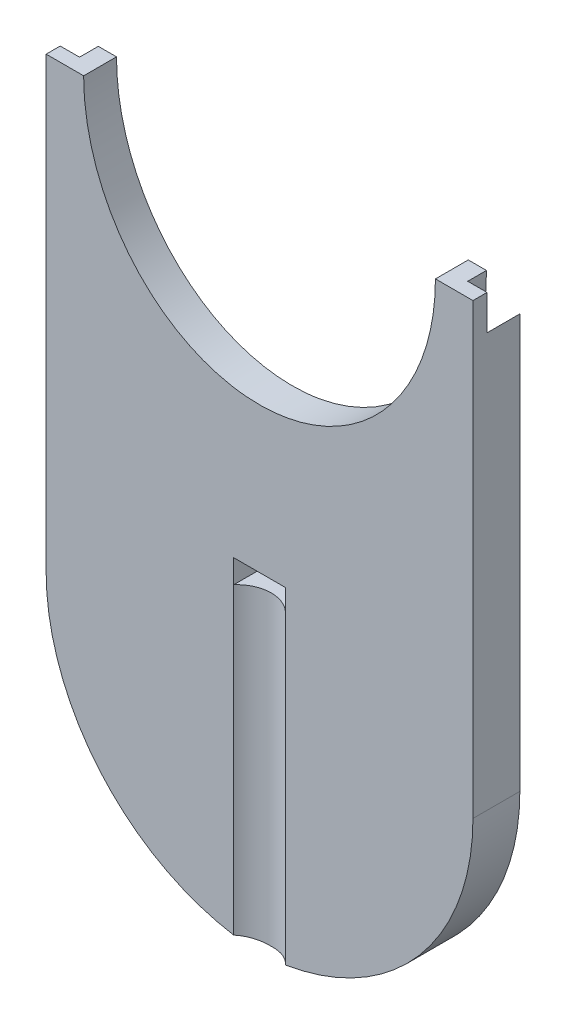
ISO-10303-21;
HEADER;
FILE_DESCRIPTION(('STEP AP214'),'2;1');
FILE_NAME('part.step','',(''),(''),'','','');
FILE_SCHEMA(('AUTOMOTIVE_DESIGN { 1 0 10303 214 1 1 1 1 }'));
ENDSEC;
DATA;
#1=APPLICATION_CONTEXT('core data for automotive mechanical design processes');
#2=APPLICATION_PROTOCOL_DEFINITION('international standard','automotive_design',2000,#1);
#3=PRODUCT_CONTEXT('',#1,'mechanical');
#4=PRODUCT('Part','Part','',(#3));
#5=PRODUCT_RELATED_PRODUCT_CATEGORY('part','',(#4));
#6=PRODUCT_DEFINITION_FORMATION('','',#4);
#7=PRODUCT_DEFINITION_CONTEXT('part definition',#1,'design');
#8=PRODUCT_DEFINITION('design','',#6,#7);
#9=PRODUCT_DEFINITION_SHAPE('','',#8);
#10=(LENGTH_UNIT() NAMED_UNIT(*) SI_UNIT(.MILLI.,.METRE.));
#11=(NAMED_UNIT(*) PLANE_ANGLE_UNIT() SI_UNIT($,.RADIAN.));
#12=(NAMED_UNIT(*) SI_UNIT($,.STERADIAN.) SOLID_ANGLE_UNIT());
#13=UNCERTAINTY_MEASURE_WITH_UNIT(LENGTH_MEASURE(1.E-05),#10,'distance_accuracy_value','');
#14=(GEOMETRIC_REPRESENTATION_CONTEXT(3) GLOBAL_UNCERTAINTY_ASSIGNED_CONTEXT((#13)) GLOBAL_UNIT_ASSIGNED_CONTEXT((#10,
#11,#12)) REPRESENTATION_CONTEXT('',''));
#15=CARTESIAN_POINT('',(0.,0.,0.));
#16=DIRECTION('',(0.,0.,1.));
#17=DIRECTION('',(1.,0.,0.));
#18=AXIS2_PLACEMENT_3D('',#15,#16,#17);
#19=CARTESIAN_POINT('',(22.75,-25.1249989546407,10.));
#20=DIRECTION('',(0.,0.,1.));
#21=DIRECTION('',(1.,0.,0.));
#22=AXIS2_PLACEMENT_3D('',#19,#20,#21);
#23=PLANE('',#22);
#24=DIRECTION('',(0.,1.,0.));
#25=VECTOR('',#24,1.);
#26=CARTESIAN_POINT('',(-5.5084218576703,-72.9803547251444,10.));
#27=LINE('',#26,#25);
#28=CARTESIAN_POINT('',(-5.5084218576703,-142.676781002882,10.));
#29=VERTEX_POINT('',#28);
#30=CARTESIAN_POINT('',(-5.5084218576703,-77.9803547251444,10.));
#31=VERTEX_POINT('',#30);
#32=EDGE_CURVE('E349',#29,#31,#27,.T.);
#33=ORIENTED_EDGE('',*,*,#32,.T.);
#34=DIRECTION('',(0.,1.,0.));
#35=VECTOR('',#34,1.);
#36=CARTESIAN_POINT('',(-5.5084218576703,-49.0526768398925,10.));
#37=LINE('',#36,#35);
#38=CARTESIAN_POINT('',(-5.5084218576703,-72.9803547251444,10.));
#39=VERTEX_POINT('',#38);
#40=EDGE_CURVE('E257',#31,#39,#37,.T.);
#41=ORIENTED_EDGE('',*,*,#40,.T.);
#42=DIRECTION('',(1.,0.,0.));
#43=VECTOR('',#42,1.);
#44=CARTESIAN_POINT('',(14.1207890711649,-72.9803547251444,10.));
#45=LINE('',#44,#43);
#46=CARTESIAN_POINT('',(5.4915781423297,-72.9803547251444,10.));
#47=VERTEX_POINT('',#46);
#48=EDGE_CURVE('E370',#39,#47,#45,.T.);
#49=ORIENTED_EDGE('',*,*,#48,.T.);
#50=DIRECTION('',(0.,-1.,0.));
#51=VECTOR('',#50,1.);
#52=CARTESIAN_POINT('',(5.49157814232972,-51.5526768398925,10.));
#53=LINE('',#52,#51);
#54=CARTESIAN_POINT('',(5.4915781423297,-77.9803547251444,10.));
#55=VERTEX_POINT('',#54);
#56=EDGE_CURVE('E374',#47,#55,#53,.T.);
#57=ORIENTED_EDGE('',*,*,#56,.T.);
#58=DIRECTION('',(0.,-1.,0.));
#59=VECTOR('',#58,1.);
#60=CARTESIAN_POINT('',(5.4915781423297,-72.9803547251444,10.));
#61=LINE('',#60,#59);
#62=CARTESIAN_POINT('',(5.4915781423297,-142.679527400056,10.));
#63=VERTEX_POINT('',#62);
#64=EDGE_CURVE('E360',#55,#63,#61,.T.);
#65=ORIENTED_EDGE('',*,*,#64,.T.);
#66=CARTESIAN_POINT('',(-2.17163325661595,-95.6278557144678,10.));
#67=DIRECTION('',(0.,0.,1.));
#68=DIRECTION('',(0.045553993187648,-0.99896187800369,0.));
#69=AXIS2_PLACEMENT_3D('',#66,#67,#68);
#70=CIRCLE('',#69,47.6716332566159);
#71=CARTESIAN_POINT('',(45.5,-95.6278557144678,10.));
#72=VERTEX_POINT('',#71);
#73=EDGE_CURVE('E397',#63,#72,#70,.T.);
#74=ORIENTED_EDGE('',*,*,#73,.T.);
#75=DIRECTION('',(0.,1.,0.));
#76=VECTOR('',#75,1.);
#77=CARTESIAN_POINT('',(45.5,-50.25,10.));
#78=LINE('',#77,#76);
#79=CARTESIAN_POINT('',(45.5,2.09071863821464E-06,10.));
#80=VERTEX_POINT('',#79);
#81=EDGE_CURVE('E10',#72,#80,#78,.T.);
#82=ORIENTED_EDGE('',*,*,#81,.T.);
#83=DIRECTION('',(1.,0.,0.));
#84=VECTOR('',#83,1.);
#85=CARTESIAN_POINT('',(-45.5,0.,10.));
#86=LINE('',#85,#84);
#87=CARTESIAN_POINT('',(37.5,0.,10.));
#88=VERTEX_POINT('',#87);
#89=EDGE_CURVE('E320',#88,#80,#86,.T.);
#90=ORIENTED_EDGE('',*,*,#89,.F.);
#91=CARTESIAN_POINT('',(0.,0.,10.));
#92=DIRECTION('',(0.,0.,-1.));
#93=DIRECTION('',(0.,1.,0.));
#94=AXIS2_PLACEMENT_3D('',#91,#92,#93);
#95=ELLIPSE('',#94,42.,37.5);
#96=CARTESIAN_POINT('',(-37.5,0.,10.));
#97=VERTEX_POINT('',#96);
#98=EDGE_CURVE('E296',#88,#97,#95,.T.);
#99=ORIENTED_EDGE('',*,*,#98,.T.);
#100=DIRECTION('',(1.,0.,0.));
#101=VECTOR('',#100,1.);
#102=CARTESIAN_POINT('',(-45.5,0.,10.));
#103=LINE('',#102,#101);
#104=CARTESIAN_POINT('',(-45.5,2.09071863821464E-06,10.));
#105=VERTEX_POINT('',#104);
#106=EDGE_CURVE('E331',#105,#97,#103,.T.);
#107=ORIENTED_EDGE('',*,*,#106,.F.);
#108=DIRECTION('',(0.,-1.,0.));
#109=VECTOR('',#108,1.);
#110=CARTESIAN_POINT('',(-45.5,-50.25,10.));
#111=LINE('',#110,#109);
#112=CARTESIAN_POINT('',(-45.5,-95.6278557144678,10.));
#113=VERTEX_POINT('',#112);
#114=EDGE_CURVE('E283',#105,#113,#111,.T.);
#115=ORIENTED_EDGE('',*,*,#114,.T.);
#116=CARTESIAN_POINT('',(2.17163325661593,-95.6278557144678,10.));
#117=DIRECTION('',(0.,0.,1.));
#118=DIRECTION('',(-1.,0.,0.));
#119=AXIS2_PLACEMENT_3D('',#116,#117,#118);
#120=CIRCLE('',#119,47.6716332566159);
#121=EDGE_CURVE('E25',#113,#29,#120,.T.);
#122=ORIENTED_EDGE('',*,*,#121,.T.);
#123=EDGE_LOOP('',(#33,#41,#49,#57,#65,#74,#82,#90,#99,#107,#115,#122));
#124=FACE_BOUND('',#123,.T.);
#125=ADVANCED_FACE('F16',(#124),#23,.T.);
#126=CARTESIAN_POINT('',(45.5,-95.6278557144678,0.));
#127=DIRECTION('',(1.,0.,0.));
#128=DIRECTION('',(0.,1.,0.));
#129=AXIS2_PLACEMENT_3D('',#126,#127,#128);
#130=PLANE('',#129);
#131=DIRECTION('',(0.,1.,0.));
#132=VECTOR('',#131,1.);
#133=CARTESIAN_POINT('',(45.5,-48.4694449461962,7.));
#134=LINE('',#133,#132);
#135=CARTESIAN_POINT('',(45.5,-7.45529948541666,7.));
#136=VERTEX_POINT('',#135);
#137=CARTESIAN_POINT('',(45.5,1.48549092556343E-08,7.));
#138=VERTEX_POINT('',#137);
#139=EDGE_CURVE('E341',#136,#138,#134,.T.);
#140=ORIENTED_EDGE('',*,*,#139,.T.);
#141=DIRECTION('',(0.,0.,1.));
#142=VECTOR('',#141,1.);
#143=CARTESIAN_POINT('',(45.5,2.09071864709642E-06,0.));
#144=LINE('',#143,#142);
#145=EDGE_CURVE('E324',#138,#80,#144,.T.);
#146=ORIENTED_EDGE('',*,*,#145,.T.);
#147=ORIENTED_EDGE('',*,*,#81,.F.);
#148=DIRECTION('',(0.,0.,1.));
#149=VECTOR('',#148,1.);
#150=CARTESIAN_POINT('',(45.5,-95.6278557144678,0.));
#151=LINE('',#150,#149);
#152=CARTESIAN_POINT('',(45.5,-95.6278557144678,0.));
#153=VERTEX_POINT('',#152);
#154=EDGE_CURVE('E393',#153,#72,#151,.T.);
#155=ORIENTED_EDGE('',*,*,#154,.F.);
#156=DIRECTION('',(0.,1.,0.));
#157=VECTOR('',#156,1.);
#158=CARTESIAN_POINT('',(45.5,-50.25,0.));
#159=LINE('',#158,#157);
#160=CARTESIAN_POINT('',(45.5,-7.45529948541665,0.));
#161=VERTEX_POINT('',#160);
#162=EDGE_CURVE('E317',#153,#161,#159,.T.);
#163=ORIENTED_EDGE('',*,*,#162,.T.);
#164=CARTESIAN_POINT('',(45.5,-7.45529948541668,0.));
#165=CARTESIAN_POINT('',(45.5,-7.45529948541668,1.16666666666667));
#166=CARTESIAN_POINT('',(45.5,-7.4552994854167,2.33333333333333));
#167=CARTESIAN_POINT('',(45.5,-7.4552994854167,4.66666666666667));
#168=CARTESIAN_POINT('',(45.5,-7.45529948541668,5.83333333333333));
#169=CARTESIAN_POINT('',(45.5,-7.45529948541668,7.));
#170=(BOUNDED_CURVE() B_SPLINE_CURVE(3,(#164,#165,#166,#167,#168,#169),.UNSPECIFIED.,.F.,
.F.) B_SPLINE_CURVE_WITH_KNOTS((4,2,4),(0.,0.35,0.7),
.UNSPECIFIED.) CURVE() GEOMETRIC_REPRESENTATION_ITEM() RATIONAL_B_SPLINE_CURVE((1.,1.,1.,1.,1.,1.)) REPRESENTATION_ITEM(''));
#171=EDGE_CURVE('E219',#161,#136,#170,.T.);
#172=ORIENTED_EDGE('',*,*,#171,.T.);
#173=EDGE_LOOP('',(#140,#146,#147,#155,#163,#172));
#174=FACE_BOUND('',#173,.T.);
#175=ADVANCED_FACE('F524',(#174),#130,.T.);
#176=CARTESIAN_POINT('',(2.17163325661593,-95.6278557144678,0.));
#177=DIRECTION('',(0.,0.,1.));
#178=DIRECTION('',(-1.,0.,0.));
#179=AXIS2_PLACEMENT_3D('',#176,#177,#178);
#180=CYLINDRICAL_SURFACE('',#179,47.6716332566159);
#181=CARTESIAN_POINT('',(0.,-143.25,7.50000485806234));
#182=CARTESIAN_POINT('',(-0.132266234072011,-143.243970799422,7.49983934604242));
#183=CARTESIAN_POINT('',(-0.264520868757158,-143.237385382734,7.50311496688742));
#184=CARTESIAN_POINT('',(-0.527456060357194,-143.223198539967,7.51663436261154));
#185=CARTESIAN_POINT('',(-0.658140278993675,-143.215606486264,7.52681705138826));
#186=CARTESIAN_POINT('',(-0.917930342853592,-143.199444566909,7.55414736714306));
#187=CARTESIAN_POINT('',(-1.04704095310796,-143.190880800687,7.57125310819131));
#188=CARTESIAN_POINT('',(-1.30367544691454,-143.172816950904,7.61240565050816));
#189=CARTESIAN_POINT('',(-1.43120299533039,-143.163319835615,7.63643088840948));
#190=CARTESIAN_POINT('',(-1.68466795864271,-143.14342913452,7.69140230488229));
#191=CARTESIAN_POINT('',(-1.81060559707415,-143.133035676382,7.72234749882493));
#192=CARTESIAN_POINT('',(-2.06088868148641,-143.111391791236,7.79113956352674));
#193=CARTESIAN_POINT('',(-2.18522865897559,-143.100139038207,7.82900558369432));
#194=CARTESIAN_POINT('',(-2.43232133256894,-143.076814678625,7.91161268590655));
#195=CARTESIAN_POINT('',(-2.55506087677138,-143.064738755383,7.9563918639072));
#196=CARTESIAN_POINT('',(-2.79894466796249,-143.039807063961,8.05283165125828));
#197=CARTESIAN_POINT('',(-2.92006633012146,-143.026945515162,8.10454777778846));
#198=CARTESIAN_POINT('',(-3.15894016168604,-143.000674700601,8.21391406508495));
#199=CARTESIAN_POINT('',(-3.27670394494916,-142.987267851546,8.27153946666427));
#200=CARTESIAN_POINT('',(-3.50795697526813,-142.960088940597,8.39228801908526));
#201=CARTESIAN_POINT('',(-3.62147544018404,-142.946321332881,8.45535614804144));
#202=CARTESIAN_POINT('',(-3.84423414676965,-142.918515202438,8.58699862455977));
#203=CARTESIAN_POINT('',(-3.95349743215646,-142.904479027387,8.65553444610474));
#204=CARTESIAN_POINT('',(-4.16776197365419,-142.876224140182,8.79808851154432));
#205=CARTESIAN_POINT('',(-4.27277776441985,-142.862006317345,8.87208507813975));
#206=CARTESIAN_POINT('',(-4.47856166401248,-142.833473030899,9.02554546418058));
#207=CARTESIAN_POINT('',(-4.57933379283184,-142.819157675334,9.10500391277876));
#208=CARTESIAN_POINT('',(-4.77664970840479,-142.790509783494,9.26937078447344));
#209=CARTESIAN_POINT('',(-4.87318527823608,-142.776177264816,9.35428907363077));
#210=CARTESIAN_POINT('',(-5.06204456818289,-142.747572286002,9.52956243617465));
#211=CARTESIAN_POINT('',(-5.15434652513537,-142.733300418478,9.61994103691601));
#212=CARTESIAN_POINT('',(-5.3347742099065,-142.704886866223,9.80611512995563));
#213=CARTESIAN_POINT('',(-5.42286395294517,-142.690746927988,9.90194577742113));
#214=CARTESIAN_POINT('',(-5.50842185767039,-142.676781002882,10.));
#215=B_SPLINE_CURVE_WITH_KNOTS('',3,(#181,#182,#183,#184,#185,#186,#187,#188,#189,#190,#191,
#192,#193,#194,#195,#196,#197,#198,#199,#200,#201,#202,#203,#204,#205,#206,#207,#208,#209,#210,
#211,#212,#213,#214),.UNSPECIFIED.,.F.,.F.,(4,2,2,2,2,2,2,2,2,2,2,2,2,2,2,2,4),(0.,
0.39717922357584,0.79089081964116,1.18225516161429,1.57241284454208,1.96251504787677,
2.35371344089033,2.74715006669928,3.14394764301723,3.53914580567487,3.93073436351749,
4.31977320328926,4.7073431311812,5.09453725518362,5.4824518609409,5.8721771547303,
6.26478825994508),.UNSPECIFIED.);
#216=CARTESIAN_POINT('',(0.,-143.25,7.50000485806234));
#217=VERTEX_POINT('',#216);
#218=EDGE_CURVE('E488',#217,#29,#215,.T.);
#219=ORIENTED_EDGE('',*,*,#218,.T.);
#220=ORIENTED_EDGE('',*,*,#121,.F.);
#221=DIRECTION('',(0.,0.,1.));
#222=VECTOR('',#221,1.);
#223=CARTESIAN_POINT('',(-45.5,-95.6278557144678,0.));
#224=LINE('',#223,#222);
#225=CARTESIAN_POINT('',(-45.5,-95.6278557144678,0.));
#226=VERTEX_POINT('',#225);
#227=EDGE_CURVE('E279',#226,#113,#224,.T.);
#228=ORIENTED_EDGE('',*,*,#227,.F.);
#229=CARTESIAN_POINT('',(2.17163325661593,-95.6278557144678,0.));
#230=DIRECTION('',(0.,0.,1.));
#231=DIRECTION('',(-1.,0.,0.));
#232=AXIS2_PLACEMENT_3D('',#229,#230,#231);
#233=CIRCLE('',#232,47.6716332566159);
#234=CARTESIAN_POINT('',(0.,-143.25,0.));
#235=VERTEX_POINT('',#234);
#236=EDGE_CURVE('E226',#226,#235,#233,.T.);
#237=ORIENTED_EDGE('',*,*,#236,.T.);
#238=DIRECTION('',(0.,0.,1.));
#239=VECTOR('',#238,1.);
#240=CARTESIAN_POINT('',(0.,-143.25,0.));
#241=LINE('',#240,#239);
#242=EDGE_CURVE('E46',#235,#217,#241,.T.);
#243=ORIENTED_EDGE('',*,*,#242,.T.);
#244=EDGE_LOOP('',(#219,#220,#228,#237,#243));
#245=FACE_BOUND('',#244,.T.);
#246=ADVANCED_FACE('F417',(#245),#180,.T.);
#247=CARTESIAN_POINT('',(-2.17163325661595,-95.6278557144678,0.));
#248=DIRECTION('',(0.,0.,1.));
#249=DIRECTION('',(0.045553993187648,-0.99896187800369,0.));
#250=AXIS2_PLACEMENT_3D('',#247,#248,#249);
#251=CYLINDRICAL_SURFACE('',#250,47.6716332566159);
#252=CARTESIAN_POINT('',(5.49157814232965,-142.679527400056,10.));
#253=CARTESIAN_POINT('',(5.40629364962369,-142.693417358953,9.90225923486806));
#254=CARTESIAN_POINT('',(5.31849130161811,-142.70747967928,9.80672983022758));
#255=CARTESIAN_POINT('',(5.13865322151899,-142.735737836954,9.62111571176352));
#256=CARTESIAN_POINT('',(5.04665267379115,-142.749931974671,9.53099663579133));
#257=CARTESIAN_POINT('',(4.85841109105706,-142.778381804661,9.35619987930545));
#258=CARTESIAN_POINT('',(4.76219118698833,-142.792636925556,9.27149936797997));
#259=CARTESIAN_POINT('',(4.5655213324165,-142.821130872378,9.10752570825447));
#260=CARTESIAN_POINT('',(4.46507914014719,-142.835369682714,9.02824325288778));
#261=CARTESIAN_POINT('',(4.25996971566595,-142.86375127191,8.87509269547319));
#262=CARTESIAN_POINT('',(4.15529816900696,-142.877893934587,8.80123035046421));
#263=CARTESIAN_POINT('',(3.94173666536859,-142.906000445045,8.65890261389557));
#264=CARTESIAN_POINT('',(3.83283202548166,-142.919963395304,8.59045908410692));
#265=CARTESIAN_POINT('',(3.6108048064972,-142.94762561495,8.4589598079323));
#266=CARTESIAN_POINT('',(3.49765915323556,-142.961322539094,8.39594255629085));
#267=CARTESIAN_POINT('',(3.26716681182787,-142.988363101772,8.27525262514056));
#268=CARTESIAN_POINT('',(3.14979097171889,-143.001702308116,8.21763469279182));
#269=CARTESIAN_POINT('',(2.91171514809088,-143.027840826246,8.10825428678714));
#270=CARTESIAN_POINT('',(2.79100390748646,-143.040637808596,8.05651573090725));
#271=CARTESIAN_POINT('',(2.54792799767465,-143.06544791765,7.95999371382921));
#272=CARTESIAN_POINT('',(2.42558562085651,-143.077466708172,7.9151556688715));
#273=CARTESIAN_POINT('',(2.17927506516264,-143.100684056865,7.83239153454287));
#274=CARTESIAN_POINT('',(2.05531981848716,-143.111886829381,7.79442816348843));
#275=CARTESIAN_POINT('',(1.80579357008623,-143.133437821015,7.72540278387752));
#276=CARTESIAN_POINT('',(1.68022788357395,-143.143788282776,7.69432227486912));
#277=CARTESIAN_POINT('',(1.4274941125835,-143.163599825986,7.63904164294762));
#278=CARTESIAN_POINT('',(1.30032569712454,-143.1730607202,7.61484296635155));
#279=CARTESIAN_POINT('',(1.0443966176023,-143.191058723144,7.57330520693217));
#280=CARTESIAN_POINT('',(0.915632202653743,-143.199592831637,7.55598794652357));
#281=CARTESIAN_POINT('',(0.65652156871844,-143.215701786283,7.52819640794482));
#282=CARTESIAN_POINT('',(0.526170493265594,-143.223270531053,7.51776406725542));
#283=CARTESIAN_POINT('',(0.263888610518901,-143.237416817577,7.50370755276247));
#284=CARTESIAN_POINT('',(0.131954018319664,-143.24398501564,7.50014431618306));
#285=CARTESIAN_POINT('',(0.,-143.25,7.50000485806234));
#286=B_SPLINE_CURVE_WITH_KNOTS('',3,(#252,#253,#254,#255,#256,#257,#258,#259,#260,#261,#262,
#263,#264,#265,#266,#267,#268,#269,#270,#271,#272,#273,#274,#275,#276,#277,#278,#279,#280,#281,
#282,#283,#284,#285),.UNSPECIFIED.,.F.,.F.,(4,2,2,2,2,2,2,2,2,2,2,2,2,2,2,2,4),(0.,
0.391346126638425,0.779863722880808,1.16661876226456,1.55269181757916,1.93916918138053,
2.32713374938534,2.71765604500112,3.11178574978258,3.50746537893631,3.8998335425977,
4.29000561656422,4.67911586217709,5.06830782462753,5.45872433101097,5.85149751959477,
6.24773932865095),.UNSPECIFIED.);
#287=EDGE_CURVE('E400',#63,#217,#286,.T.);
#288=ORIENTED_EDGE('',*,*,#287,.T.);
#289=ORIENTED_EDGE('',*,*,#242,.F.);
#290=CARTESIAN_POINT('',(-2.17163325661595,-95.6278557144678,0.));
#291=DIRECTION('',(0.,0.,1.));
#292=DIRECTION('',(0.045553993187648,-0.99896187800369,0.));
#293=AXIS2_PLACEMENT_3D('',#290,#291,#292);
#294=CIRCLE('',#293,47.6716332566159);
#295=EDGE_CURVE('E229',#235,#153,#294,.T.);
#296=ORIENTED_EDGE('',*,*,#295,.T.);
#297=ORIENTED_EDGE('',*,*,#154,.T.);
#298=ORIENTED_EDGE('',*,*,#73,.F.);
#299=EDGE_LOOP('',(#288,#289,#296,#297,#298));
#300=FACE_BOUND('',#299,.T.);
#301=ADVANCED_FACE('F407',(#300),#251,.T.);
#302=CARTESIAN_POINT('',(22.75,-25.1249989546407,0.));
#303=DIRECTION('',(0.,0.,1.));
#304=DIRECTION('',(1.,0.,0.));
#305=AXIS2_PLACEMENT_3D('',#302,#303,#304);
#306=PLANE('',#305);
#307=CARTESIAN_POINT('',(0.,-94.,0.));
#308=DIRECTION('',(0.,0.,1.));
#309=DIRECTION('',(1.,0.,0.));
#310=AXIS2_PLACEMENT_3D('',#307,#308,#309);
#311=CIRCLE('',#310,35.);
#312=CARTESIAN_POINT('',(-35.,-94.,0.));
#313=VERTEX_POINT('',#312);
#314=EDGE_CURVE('E195',#313,#313,#311,.T.);
#315=ORIENTED_EDGE('',*,*,#314,.T.);
#316=EDGE_LOOP('',(#315));
#317=FACE_BOUND('',#316,.T.);
#318=CARTESIAN_POINT('',(-45.5,-7.40077679004306,0.));
#319=CARTESIAN_POINT('',(-44.9242894961324,-11.7092066995012,0.));
#320=CARTESIAN_POINT('',(-43.8513307317373,-15.936979239285,0.));
#321=CARTESIAN_POINT('',(-42.2999120771305,-19.9426239226419,0.));
#322=CARTESIAN_POINT('',(-39.2436607412134,-27.8336318580996,0.));
#323=CARTESIAN_POINT('',(-34.3377834230488,-34.8459322215829,0.));
#324=CARTESIAN_POINT('',(-28.1852994199222,-40.1083439337288,0.));
#325=CARTESIAN_POINT('',(-22.1148975575752,-45.3005482274113,0.));
#326=CARTESIAN_POINT('',(-14.8436614856178,-48.7784209894615,0.));
#327=CARTESIAN_POINT('',(-7.25192964079896,-50.1154345595724,0.));
#328=CARTESIAN_POINT('',(0.284202415795431,-51.4426562043531,0.));
#329=CARTESIAN_POINT('',(8.11962100097684,-50.6574404472079,0.));
#330=CARTESIAN_POINT('',(15.3141856693824,-47.8553005094194,0.));
#331=CARTESIAN_POINT('',(22.5550355889471,-45.0351333862789,0.));
#332=CARTESIAN_POINT('',(29.1313878144454,-40.1784440123707,0.));
#333=CARTESIAN_POINT('',(34.2518511635703,-33.8768129275057,0.));
#334=CARTESIAN_POINT('',(39.717473812193,-27.1504025946224,0.));
#335=CARTESIAN_POINT('',(43.5075621558035,-18.7899813228029,0.));
#336=CARTESIAN_POINT('',(45.1096223466372,-9.9372824846293,0.));
#337=CARTESIAN_POINT('',(45.2586684125514,-9.11368051130592,0.));
#338=CARTESIAN_POINT('',(45.388776121754,-8.28601168547003,0.));
#339=CARTESIAN_POINT('',(45.5,-7.45529948541665,0.));
#340=(BOUNDED_CURVE() B_SPLINE_CURVE(3,(#318,#319,#320,#321,#322,#323,#324,#325,#326,#327,#328,
#329,#330,#331,#332,#333,#334,#335,#336,#337,#338,#339),.UNSPECIFIED.,.F.,
.F.) B_SPLINE_CURVE_WITH_KNOTS((4,3,3,3,3,3,3,4),(-4.56587821234115,-4.30819866157579,
-3.80057715726638,-3.29972798422322,-2.80254689489572,-2.30216725879691,-1.76805811954515,
-1.7183678105107),
.UNSPECIFIED.) CURVE() GEOMETRIC_REPRESENTATION_ITEM() RATIONAL_B_SPLINE_CURVE((1.,1.,1.,1.,1.,
1.,1.,1.,1.,1.,1.,1.,1.,1.,1.,1.,1.,1.,1.,1.,1.,1.)) REPRESENTATION_ITEM(''));
#341=CARTESIAN_POINT('',(-45.5,-7.40077679004306,0.));
#342=VERTEX_POINT('',#341);
#343=EDGE_CURVE('E235',#342,#161,#340,.T.);
#344=ORIENTED_EDGE('',*,*,#343,.T.);
#345=ORIENTED_EDGE('',*,*,#162,.F.);
#346=ORIENTED_EDGE('',*,*,#295,.F.);
#347=ORIENTED_EDGE('',*,*,#236,.F.);
#348=DIRECTION('',(0.,-1.,0.));
#349=VECTOR('',#348,1.);
#350=CARTESIAN_POINT('',(-45.5,-50.25,0.));
#351=LINE('',#350,#349);
#352=EDGE_CURVE('E275',#342,#226,#351,.T.);
#353=ORIENTED_EDGE('',*,*,#352,.F.);
#354=EDGE_LOOP('',(#344,#345,#346,#347,#353));
#355=FACE_BOUND('',#354,.T.);
#356=ADVANCED_FACE('F201',(#317,#355),#306,.F.);
#357=CARTESIAN_POINT('',(0.,-94.,0.));
#358=DIRECTION('',(0.,0.,-1.));
#359=DIRECTION('',(1.,0.,0.));
#360=AXIS2_PLACEMENT_3D('',#357,#358,#359);
#361=CYLINDRICAL_SURFACE('',#360,32.);
#362=CARTESIAN_POINT('',(0.,-94.,-13.));
#363=DIRECTION('',(0.,0.,-1.));
#364=DIRECTION('',(1.,0.,0.));
#365=AXIS2_PLACEMENT_3D('',#362,#363,#364);
#366=CIRCLE('',#365,32.);
#367=CARTESIAN_POINT('',(-32.,-94.,-13.));
#368=VERTEX_POINT('',#367);
#369=EDGE_CURVE('E380',#368,#368,#366,.T.);
#370=ORIENTED_EDGE('',*,*,#369,.F.);
#371=DIRECTION('',(0.,0.,1.));
#372=VECTOR('',#371,1.);
#373=CARTESIAN_POINT('',(-32.,-94.,0.));
#374=LINE('',#373,#372);
#375=CARTESIAN_POINT('',(-32.,-94.,3.));
#376=VERTEX_POINT('',#375);
#377=EDGE_CURVE('E300',#368,#376,#374,.T.);
#378=ORIENTED_EDGE('',*,*,#377,.T.);
#379=CARTESIAN_POINT('',(0.,-94.,3.));
#380=DIRECTION('',(0.,0.,-1.));
#381=DIRECTION('',(1.,0.,0.));
#382=AXIS2_PLACEMENT_3D('',#379,#380,#381);
#383=CIRCLE('',#382,32.);
#384=EDGE_CURVE('E214',#376,#376,#383,.T.);
#385=ORIENTED_EDGE('',*,*,#384,.T.);
#386=ORIENTED_EDGE('',*,*,#377,.F.);
#387=EDGE_LOOP('',(#370,#378,#385,#386));
#388=FACE_BOUND('',#387,.T.);
#389=ADVANCED_FACE('F583',(#388),#361,.T.);
#390=CARTESIAN_POINT('',(0.,-94.,0.));
#391=DIRECTION('',(0.,0.,-1.));
#392=DIRECTION('',(1.,0.,0.));
#393=AXIS2_PLACEMENT_3D('',#390,#391,#392);
#394=CYLINDRICAL_SURFACE('',#393,27.5);
#395=CARTESIAN_POINT('',(0.,-94.,-13.));
#396=DIRECTION('',(0.,0.,1.));
#397=DIRECTION('',(1.,0.,0.));
#398=AXIS2_PLACEMENT_3D('',#395,#396,#397);
#399=CIRCLE('',#398,27.5);
#400=CARTESIAN_POINT('',(-27.5,-94.,-13.));
#401=VERTEX_POINT('',#400);
#402=EDGE_CURVE('E384',#401,#401,#399,.T.);
#403=ORIENTED_EDGE('',*,*,#402,.F.);
#404=DIRECTION('',(0.,0.,1.));
#405=VECTOR('',#404,1.);
#406=CARTESIAN_POINT('',(-27.5,-94.,0.));
#407=LINE('',#406,#405);
#408=CARTESIAN_POINT('',(-27.5,-94.,5.));
#409=VERTEX_POINT('',#408);
#410=EDGE_CURVE('E297',#401,#409,#407,.T.);
#411=ORIENTED_EDGE('',*,*,#410,.T.);
#412=CARTESIAN_POINT('',(0.,-94.,5.));
#413=DIRECTION('',(0.,0.,1.));
#414=DIRECTION('',(1.,0.,0.));
#415=AXIS2_PLACEMENT_3D('',#412,#413,#414);
#416=CIRCLE('',#415,27.5);
#417=EDGE_CURVE('E301',#409,#409,#416,.T.);
#418=ORIENTED_EDGE('',*,*,#417,.T.);
#419=ORIENTED_EDGE('',*,*,#410,.F.);
#420=EDGE_LOOP('',(#403,#411,#418,#419));
#421=FACE_BOUND('',#420,.T.);
#422=ADVANCED_FACE('F572',(#421),#394,.F.);
#423=CARTESIAN_POINT('',(22.75,-25.1249989546407,5.));
#424=DIRECTION('',(0.,0.,1.));
#425=DIRECTION('',(1.,0.,0.));
#426=AXIS2_PLACEMENT_3D('',#423,#424,#425);
#427=PLANE('',#426);
#428=DIRECTION('',(0.,1.,0.));
#429=VECTOR('',#428,1.);
#430=CARTESIAN_POINT('',(5.49157814232972,-51.5526768398925,5.));
#431=LINE('',#430,#429);
#432=CARTESIAN_POINT('',(5.4915781423297,-77.9803547251444,5.));
#433=VERTEX_POINT('',#432);
#434=CARTESIAN_POINT('',(5.4915781423297,-72.9803547251444,5.));
#435=VERTEX_POINT('',#434);
#436=EDGE_CURVE('E377',#433,#435,#431,.T.);
#437=ORIENTED_EDGE('',*,*,#436,.T.);
#438=DIRECTION('',(-1.,0.,0.));
#439=VECTOR('',#438,1.);
#440=CARTESIAN_POINT('',(14.1207890711649,-72.9803547251444,5.));
#441=LINE('',#440,#439);
#442=CARTESIAN_POINT('',(-5.5084218576703,-72.9803547251444,5.));
#443=VERTEX_POINT('',#442);
#444=EDGE_CURVE('E335',#435,#443,#441,.T.);
#445=ORIENTED_EDGE('',*,*,#444,.T.);
#446=DIRECTION('',(0.,-1.,0.));
#447=VECTOR('',#446,1.);
#448=CARTESIAN_POINT('',(-5.5084218576703,-49.0526768398925,5.));
#449=LINE('',#448,#447);
#450=CARTESIAN_POINT('',(-5.5084218576703,-77.9803547251444,5.));
#451=VERTEX_POINT('',#450);
#452=EDGE_CURVE('E250',#443,#451,#449,.T.);
#453=ORIENTED_EDGE('',*,*,#452,.T.);
#454=DIRECTION('',(1.,0.,0.));
#455=VECTOR('',#454,1.);
#456=CARTESIAN_POINT('',(8.62078907116485,-77.9803547251444,5.));
#457=LINE('',#456,#455);
#458=EDGE_CURVE('E351',#451,#433,#457,.T.);
#459=ORIENTED_EDGE('',*,*,#458,.T.);
#460=EDGE_LOOP('',(#437,#445,#453,#459));
#461=FACE_BOUND('',#460,.T.);
#462=ORIENTED_EDGE('',*,*,#417,.F.);
#463=EDGE_LOOP('',(#462));
#464=FACE_BOUND('',#463,.T.);
#465=ADVANCED_FACE('F568',(#461,#464),#427,.F.);
#466=CARTESIAN_POINT('',(0.,-94.,-13.));
#467=DIRECTION('',(0.,0.,-1.));
#468=DIRECTION('',(0.,-1.,0.));
#469=AXIS2_PLACEMENT_3D('',#466,#467,#468);
#470=PLANE('',#469);
#471=ORIENTED_EDGE('',*,*,#402,.T.);
#472=EDGE_LOOP('',(#471));
#473=FACE_BOUND('',#472,.T.);
#474=ORIENTED_EDGE('',*,*,#369,.T.);
#475=EDGE_LOOP('',(#474));
#476=FACE_BOUND('',#475,.T.);
#477=ADVANCED_FACE('F571',(#473,#476),#470,.T.);
#478=CARTESIAN_POINT('',(5.4915781423297,-77.9803547251444,5.));
#479=DIRECTION('',(1.,0.,0.));
#480=DIRECTION('',(0.,-1.,0.));
#481=AXIS2_PLACEMENT_3D('',#478,#479,#480);
#482=PLANE('',#481);
#483=ORIENTED_EDGE('',*,*,#56,.F.);
#484=DIRECTION('',(0.,0.,1.));
#485=VECTOR('',#484,1.);
#486=CARTESIAN_POINT('',(5.4915781423297,-72.9803547251444,5.));
#487=LINE('',#486,#485);
#488=EDGE_CURVE('E338',#435,#47,#487,.T.);
#489=ORIENTED_EDGE('',*,*,#488,.F.);
#490=ORIENTED_EDGE('',*,*,#436,.F.);
#491=DIRECTION('',(0.,0.,1.));
#492=VECTOR('',#491,1.);
#493=CARTESIAN_POINT('',(5.4915781423297,-77.9803547251444,5.));
#494=LINE('',#493,#492);
#495=EDGE_CURVE('E356',#433,#55,#494,.T.);
#496=ORIENTED_EDGE('',*,*,#495,.T.);
#497=EDGE_LOOP('',(#483,#489,#490,#496));
#498=FACE_BOUND('',#497,.T.);
#499=ADVANCED_FACE('F559',(#498),#482,.F.);
#500=CARTESIAN_POINT('',(5.4915781423297,-72.9803547251444,5.));
#501=DIRECTION('',(0.,1.,0.));
#502=DIRECTION('',(1.,0.,0.));
#503=AXIS2_PLACEMENT_3D('',#500,#501,#502);
#504=PLANE('',#503);
#505=DIRECTION('',(0.,0.,1.));
#506=VECTOR('',#505,1.);
#507=CARTESIAN_POINT('',(-5.5084218576703,-72.9803547251444,5.));
#508=LINE('',#507,#506);
#509=EDGE_CURVE('E256',#443,#39,#508,.T.);
#510=ORIENTED_EDGE('',*,*,#509,.F.);
#511=ORIENTED_EDGE('',*,*,#444,.F.);
#512=ORIENTED_EDGE('',*,*,#488,.T.);
#513=ORIENTED_EDGE('',*,*,#48,.F.);
#514=EDGE_LOOP('',(#510,#511,#512,#513));
#515=FACE_BOUND('',#514,.T.);
#516=ADVANCED_FACE('F557',(#515),#504,.F.);
#517=CARTESIAN_POINT('',(-5.5084218576703,-72.9803547251444,5.));
#518=DIRECTION('',(-1.,0.,0.));
#519=DIRECTION('',(0.,0.,1.));
#520=AXIS2_PLACEMENT_3D('',#517,#518,#519);
#521=PLANE('',#520);
#522=ORIENTED_EDGE('',*,*,#40,.F.);
#523=DIRECTION('',(0.,0.,1.));
#524=VECTOR('',#523,1.);
#525=CARTESIAN_POINT('',(-5.5084218576703,-77.9803547251444,5.));
#526=LINE('',#525,#524);
#527=EDGE_CURVE('E355',#451,#31,#526,.T.);
#528=ORIENTED_EDGE('',*,*,#527,.F.);
#529=ORIENTED_EDGE('',*,*,#452,.F.);
#530=ORIENTED_EDGE('',*,*,#509,.T.);
#531=EDGE_LOOP('',(#522,#528,#529,#530));
#532=FACE_BOUND('',#531,.T.);
#533=ADVANCED_FACE('F563',(#532),#521,.F.);
#534=CARTESIAN_POINT('',(-5.5084218576703,-77.9803547251444,5.));
#535=DIRECTION('',(0.,-1.,0.));
#536=DIRECTION('',(0.,0.,-1.));
#537=AXIS2_PLACEMENT_3D('',#534,#535,#536);
#538=PLANE('',#537);
#539=CARTESIAN_POINT('',(-0.00842185767029657,-77.9803547251444,14.8));
#540=DIRECTION('',(0.,-1.,0.));
#541=DIRECTION('',(-0.753424657534247,0.,-0.657534246575342));
#542=AXIS2_PLACEMENT_3D('',#539,#540,#541);
#543=CIRCLE('',#542,7.3);
#544=EDGE_CURVE('E344',#31,#55,#543,.T.);
#545=ORIENTED_EDGE('',*,*,#544,.T.);
#546=ORIENTED_EDGE('',*,*,#495,.F.);
#547=ORIENTED_EDGE('',*,*,#458,.F.);
#548=ORIENTED_EDGE('',*,*,#527,.T.);
#549=EDGE_LOOP('',(#545,#546,#547,#548));
#550=FACE_BOUND('',#549,.T.);
#551=ADVANCED_FACE('F464',(#550),#538,.F.);
#552=CARTESIAN_POINT('',(-0.00842185767029657,-72.9803547251444,14.8));
#553=DIRECTION('',(0.,-1.,0.));
#554=DIRECTION('',(-0.753424657534247,0.,-0.657534246575342));
#555=AXIS2_PLACEMENT_3D('',#552,#553,#554);
#556=CYLINDRICAL_SURFACE('',#555,7.3);
#557=ORIENTED_EDGE('',*,*,#544,.F.);
#558=ORIENTED_EDGE('',*,*,#32,.F.);
#559=ORIENTED_EDGE('',*,*,#218,.F.);
#560=ORIENTED_EDGE('',*,*,#287,.F.);
#561=ORIENTED_EDGE('',*,*,#64,.F.);
#562=EDGE_LOOP('',(#557,#558,#559,#560,#561));
#563=FACE_BOUND('',#562,.T.);
#564=ADVANCED_FACE('F459',(#563),#556,.F.);
#565=CARTESIAN_POINT('',(0.,-0.125000000000002,7.));
#566=DIRECTION('',(0.,0.,1.));
#567=DIRECTION('',(1.,0.,0.));
#568=AXIS2_PLACEMENT_3D('',#565,#566,#567);
#569=PLANE('',#568);
#570=DIRECTION('',(1.,0.,0.));
#571=VECTOR('',#570,1.);
#572=CARTESIAN_POINT('',(-45.5,0.,7.));
#573=LINE('',#572,#571);
#574=CARTESIAN_POINT('',(-45.5,3.52181923364218E-09,7.));
#575=VERTEX_POINT('',#574);
#576=CARTESIAN_POINT('',(-41.3811786708003,0.,7.));
#577=VERTEX_POINT('',#576);
#578=EDGE_CURVE('E334',#575,#577,#573,.T.);
#579=ORIENTED_EDGE('',*,*,#578,.T.);
#580=CARTESIAN_POINT('',(0.,0.,7.));
#581=DIRECTION('',(0.,0.,-1.));
#582=DIRECTION('',(0.,1.,0.));
#583=AXIS2_PLACEMENT_3D('',#580,#581,#582);
#584=ELLIPSE('',#583,46.1043222804377,41.3811786708003);
#585=CARTESIAN_POINT('',(41.3811786708003,0.,7.));
#586=VERTEX_POINT('',#585);
#587=EDGE_CURVE('E220',#586,#577,#584,.T.);
#588=ORIENTED_EDGE('',*,*,#587,.F.);
#589=DIRECTION('',(1.,0.,0.));
#590=VECTOR('',#589,1.);
#591=CARTESIAN_POINT('',(41.3811786708003,0.,7.));
#592=LINE('',#591,#590);
#593=EDGE_CURVE('E327',#586,#138,#592,.T.);
#594=ORIENTED_EDGE('',*,*,#593,.T.);
#595=ORIENTED_EDGE('',*,*,#139,.F.);
#596=CARTESIAN_POINT('',(-45.5,-7.40077679004299,7.));
#597=CARTESIAN_POINT('',(-44.9242894961325,-11.7092066995013,7.));
#598=CARTESIAN_POINT('',(-43.8513307317373,-15.9369792392849,7.));
#599=CARTESIAN_POINT('',(-42.2999120771305,-19.9426239226419,7.));
#600=CARTESIAN_POINT('',(-39.2436607412134,-27.8336318580996,7.));
#601=CARTESIAN_POINT('',(-34.3377834230488,-34.8459322215829,7.));
#602=CARTESIAN_POINT('',(-28.1852994199222,-40.1083439337288,7.));
#603=CARTESIAN_POINT('',(-22.1148975575752,-45.3005482274113,7.));
#604=CARTESIAN_POINT('',(-14.8436614856178,-48.7784209894615,7.));
#605=CARTESIAN_POINT('',(-7.25192964079896,-50.1154345595724,7.));
#606=CARTESIAN_POINT('',(0.284202415795431,-51.4426562043531,7.));
#607=CARTESIAN_POINT('',(8.11962100097684,-50.6574404472079,7.));
#608=CARTESIAN_POINT('',(15.3141856693824,-47.8553005094194,7.));
#609=CARTESIAN_POINT('',(22.5550355889471,-45.0351333862789,7.));
#610=CARTESIAN_POINT('',(29.1313878144454,-40.1784440123707,7.));
#611=CARTESIAN_POINT('',(34.2518511635703,-33.8768129275057,7.));
#612=CARTESIAN_POINT('',(39.717473812193,-27.1504025946224,7.));
#613=CARTESIAN_POINT('',(43.5075621558035,-18.7899813228029,7.));
#614=CARTESIAN_POINT('',(45.1096223466372,-9.9372824846293,7.));
#615=CARTESIAN_POINT('',(45.2586684125514,-9.11368051130593,7.));
#616=CARTESIAN_POINT('',(45.388776121754,-8.28601168547003,7.));
#617=CARTESIAN_POINT('',(45.5,-7.45529948541666,7.));
#618=(BOUNDED_CURVE() B_SPLINE_CURVE(3,(#596,#597,#598,#599,#600,#601,#602,#603,#604,#605,#606,
#607,#608,#609,#610,#611,#612,#613,#614,#615,#616,#617),.UNSPECIFIED.,.F.,
.F.) B_SPLINE_CURVE_WITH_KNOTS((4,3,3,3,3,3,3,4),(-4.56587821234115,-4.30819866157579,
-3.80057715726638,-3.29972798422322,-2.80254689489572,-2.30216725879691,-1.76805811954515,
-1.7183678105107),
.UNSPECIFIED.) CURVE() GEOMETRIC_REPRESENTATION_ITEM() RATIONAL_B_SPLINE_CURVE((1.,1.,1.,1.,1.,
1.,1.,1.,1.,1.,1.,1.,1.,1.,1.,1.,1.,1.,1.,1.,1.,1.)) REPRESENTATION_ITEM(''));
#619=CARTESIAN_POINT('',(-45.5,-7.40077679004299,7.));
#620=VERTEX_POINT('',#619);
#621=EDGE_CURVE('E210',#620,#136,#618,.T.);
#622=ORIENTED_EDGE('',*,*,#621,.F.);
#623=DIRECTION('',(0.,-1.,0.));
#624=VECTOR('',#623,1.);
#625=CARTESIAN_POINT('',(-45.5,-0.655516043602979,7.));
#626=LINE('',#625,#624);
#627=EDGE_CURVE('E272',#575,#620,#626,.T.);
#628=ORIENTED_EDGE('',*,*,#627,.F.);
#629=EDGE_LOOP('',(#579,#588,#594,#595,#622,#628));
#630=FACE_BOUND('',#629,.T.);
#631=ADVANCED_FACE('F463',(#630),#569,.F.);
#632=CARTESIAN_POINT('',(-45.5,0.,10.));
#633=DIRECTION('',(0.,1.,0.));
#634=DIRECTION('',(1.,0.,0.));
#635=AXIS2_PLACEMENT_3D('',#632,#633,#634);
#636=PLANE('',#635);
#637=ORIENTED_EDGE('',*,*,#106,.T.);
#638=DIRECTION('',(0.,0.,-1.));
#639=VECTOR('',#638,1.);
#640=CARTESIAN_POINT('',(-37.5,0.,10.));
#641=LINE('',#640,#639);
#642=CARTESIAN_POINT('',(-37.5,0.,3.));
#643=VERTEX_POINT('',#642);
#644=EDGE_CURVE('E270',#97,#643,#641,.T.);
#645=ORIENTED_EDGE('',*,*,#644,.T.);
#646=DIRECTION('',(1.,0.,0.));
#647=VECTOR('',#646,1.);
#648=CARTESIAN_POINT('',(-45.5,0.,3.));
#649=LINE('',#648,#647);
#650=CARTESIAN_POINT('',(-41.3811786708003,0.,3.));
#651=VERTEX_POINT('',#650);
#652=EDGE_CURVE('E314',#651,#643,#649,.T.);
#653=ORIENTED_EDGE('',*,*,#652,.F.);
#654=DIRECTION('',(0.,0.,-1.));
#655=VECTOR('',#654,1.);
#656=CARTESIAN_POINT('',(-41.3811786708003,0.,10.));
#657=LINE('',#656,#655);
#658=EDGE_CURVE('E224',#577,#651,#657,.T.);
#659=ORIENTED_EDGE('',*,*,#658,.F.);
#660=ORIENTED_EDGE('',*,*,#578,.F.);
#661=DIRECTION('',(0.,0.,1.));
#662=VECTOR('',#661,1.);
#663=CARTESIAN_POINT('',(-45.5,2.09071863821464E-06,0.));
#664=LINE('',#663,#662);
#665=EDGE_CURVE('E225',#575,#105,#664,.T.);
#666=ORIENTED_EDGE('',*,*,#665,.T.);
#667=EDGE_LOOP('',(#637,#645,#653,#659,#660,#666));
#668=FACE_BOUND('',#667,.T.);
#669=ADVANCED_FACE('F466',(#668),#636,.T.);
#670=CARTESIAN_POINT('',(41.4996728586533,0.,10.));
#671=DIRECTION('',(0.,1.,0.));
#672=DIRECTION('',(1.,0.,0.));
#673=AXIS2_PLACEMENT_3D('',#670,#671,#672);
#674=PLANE('',#673);
#675=ORIENTED_EDGE('',*,*,#89,.T.);
#676=ORIENTED_EDGE('',*,*,#145,.F.);
#677=ORIENTED_EDGE('',*,*,#593,.F.);
#678=DIRECTION('',(0.,0.,-1.));
#679=VECTOR('',#678,1.);
#680=CARTESIAN_POINT('',(41.3811786708003,0.,10.));
#681=LINE('',#680,#679);
#682=CARTESIAN_POINT('',(41.3811786708003,0.,3.));
#683=VERTEX_POINT('',#682);
#684=EDGE_CURVE('E243',#586,#683,#681,.T.);
#685=ORIENTED_EDGE('',*,*,#684,.T.);
#686=DIRECTION('',(1.,0.,0.));
#687=VECTOR('',#686,1.);
#688=CARTESIAN_POINT('',(-45.5,0.,3.));
#689=LINE('',#688,#687);
#690=CARTESIAN_POINT('',(37.5,0.,3.));
#691=VERTEX_POINT('',#690);
#692=EDGE_CURVE('E311',#691,#683,#689,.T.);
#693=ORIENTED_EDGE('',*,*,#692,.F.);
#694=DIRECTION('',(0.,0.,-1.));
#695=VECTOR('',#694,1.);
#696=CARTESIAN_POINT('',(37.5,0.,10.));
#697=LINE('',#696,#695);
#698=EDGE_CURVE('E271',#88,#691,#697,.T.);
#699=ORIENTED_EDGE('',*,*,#698,.F.);
#700=EDGE_LOOP('',(#675,#676,#677,#685,#693,#699));
#701=FACE_BOUND('',#700,.T.);
#702=ADVANCED_FACE('F457',(#701),#674,.T.);
#703=CARTESIAN_POINT('',(0.,-23.0521611402189,3.));
#704=DIRECTION('',(0.,0.,1.));
#705=DIRECTION('',(1.,0.,0.));
#706=AXIS2_PLACEMENT_3D('',#703,#704,#705);
#707=PLANE('',#706);
#708=CARTESIAN_POINT('',(0.,0.,3.));
#709=DIRECTION('',(0.,0.,1.));
#710=DIRECTION('',(0.,1.,0.));
#711=AXIS2_PLACEMENT_3D('',#708,#709,#710);
#712=ELLIPSE('',#711,42.,37.5);
#713=EDGE_CURVE('E263',#643,#691,#712,.T.);
#714=ORIENTED_EDGE('',*,*,#713,.T.);
#715=ORIENTED_EDGE('',*,*,#692,.T.);
#716=CARTESIAN_POINT('',(0.,0.,3.));
#717=DIRECTION('',(0.,0.,-1.));
#718=DIRECTION('',(0.,1.,0.));
#719=AXIS2_PLACEMENT_3D('',#716,#717,#718);
#720=ELLIPSE('',#719,46.1043222804377,41.3811786708003);
#721=EDGE_CURVE('E236',#683,#651,#720,.T.);
#722=ORIENTED_EDGE('',*,*,#721,.T.);
#723=ORIENTED_EDGE('',*,*,#652,.T.);
#724=EDGE_LOOP('',(#714,#715,#722,#723));
#725=FACE_BOUND('',#724,.T.);
#726=ADVANCED_FACE('F448',(#725),#707,.F.);
#727=CARTESIAN_POINT('',(37.5,0.,10.));
#728=CARTESIAN_POINT('',(37.5,-42.,10.));
#729=CARTESIAN_POINT('',(0.,-42.,10.));
#730=CARTESIAN_POINT('',(-37.5,-42.,10.));
#731=CARTESIAN_POINT('',(-37.5,0.,10.));
#732=CARTESIAN_POINT('',(37.5,0.,3.));
#733=CARTESIAN_POINT('',(37.5,-42.,3.));
#734=CARTESIAN_POINT('',(0.,-42.,3.));
#735=CARTESIAN_POINT('',(-37.5,-42.,3.));
#736=CARTESIAN_POINT('',(-37.5,0.,3.));
#737=(BOUNDED_SURFACE() B_SPLINE_SURFACE(1,2,((#727,#728,#729,#730,#731),(#732,#733,#734,#735,
#736)),.UNSPECIFIED.,.F.,.F.,.F.) B_SPLINE_SURFACE_WITH_KNOTS((2,2),(3,2,3),(0.,
0.166666666666667),(-4.71238898038469,-3.14159265358979,-1.5707963267949),
.UNSPECIFIED.) GEOMETRIC_REPRESENTATION_ITEM() RATIONAL_B_SPLINE_SURFACE(((1.,0.707106781186548,
1.,0.707106781186548,1.),(1.,0.707106781186548,1.,0.707106781186548,1.))) REPRESENTATION_ITEM('') SURFACE());
#738=ORIENTED_EDGE('',*,*,#98,.F.);
#739=ORIENTED_EDGE('',*,*,#698,.T.);
#740=ORIENTED_EDGE('',*,*,#713,.F.);
#741=ORIENTED_EDGE('',*,*,#644,.F.);
#742=EDGE_LOOP('',(#738,#739,#740,#741));
#743=FACE_BOUND('',#742,.T.);
#744=ADVANCED_FACE('F437',(#743),#737,.T.);
#745=CARTESIAN_POINT('',(41.3811786708003,0.,7.));
#746=CARTESIAN_POINT('',(41.3811786708003,-46.1043222804377,7.00000000000001));
#747=CARTESIAN_POINT('',(0.,-46.1043222804377,7.));
#748=CARTESIAN_POINT('',(-41.3811786708003,-46.1043222804377,7.00000000000001));
#749=CARTESIAN_POINT('',(-41.3811786708003,0.,7.));
#750=CARTESIAN_POINT('',(41.3811786708003,0.,3.));
#751=CARTESIAN_POINT('',(41.3811786708003,-46.1043222804377,3.));
#752=CARTESIAN_POINT('',(0.,-46.1043222804377,3.));
#753=CARTESIAN_POINT('',(-41.3811786708003,-46.1043222804377,3.));
#754=CARTESIAN_POINT('',(-41.3811786708003,0.,3.));
#755=(BOUNDED_SURFACE() B_SPLINE_SURFACE(1,2,((#745,#746,#747,#748,#749),(#750,#751,#752,#753,
#754)),.UNSPECIFIED.,.F.,.F.,.F.) B_SPLINE_SURFACE_WITH_KNOTS((2,2),(3,2,3),(0.0650698210408987,
0.151829582428764),(-4.71238898038469,-3.14159265358979,-1.5707963267949),
.UNSPECIFIED.) GEOMETRIC_REPRESENTATION_ITEM() RATIONAL_B_SPLINE_SURFACE(((1.,0.707106781186548,
1.,0.707106781186548,1.),(1.,0.707106781186548,1.,0.707106781186548,1.))) REPRESENTATION_ITEM('') SURFACE());
#756=ORIENTED_EDGE('',*,*,#587,.T.);
#757=ORIENTED_EDGE('',*,*,#658,.T.);
#758=ORIENTED_EDGE('',*,*,#721,.F.);
#759=ORIENTED_EDGE('',*,*,#684,.F.);
#760=EDGE_LOOP('',(#756,#757,#758,#759));
#761=FACE_BOUND('',#760,.T.);
#762=ADVANCED_FACE('F427',(#761),#755,.F.);
#763=CARTESIAN_POINT('',(-45.5,2.09071863821464E-06,0.));
#764=DIRECTION('',(-1.,0.,0.));
#765=DIRECTION('',(0.,0.,1.));
#766=AXIS2_PLACEMENT_3D('',#763,#764,#765);
#767=PLANE('',#766);
#768=ORIENTED_EDGE('',*,*,#627,.T.);
#769=CARTESIAN_POINT('',(-45.5,-7.40077679004308,7.));
#770=CARTESIAN_POINT('',(-45.5,-7.40077679004308,5.83333333333333));
#771=CARTESIAN_POINT('',(-45.5,-7.40077679004308,4.66666666666667));
#772=CARTESIAN_POINT('',(-45.5,-7.40077679004308,2.33333333333333));
#773=CARTESIAN_POINT('',(-45.5,-7.40077679004308,1.16666666666667));
#774=CARTESIAN_POINT('',(-45.5,-7.40077679004308,0.));
#775=(BOUNDED_CURVE() B_SPLINE_CURVE(3,(#769,#770,#771,#772,#773,#774),.UNSPECIFIED.,.F.,
.F.) B_SPLINE_CURVE_WITH_KNOTS((4,2,4),(0.,0.35,0.7),
.UNSPECIFIED.) CURVE() GEOMETRIC_REPRESENTATION_ITEM() RATIONAL_B_SPLINE_CURVE((1.,1.,1.,1.,1.,1.)) REPRESENTATION_ITEM(''));
#776=EDGE_CURVE('E249',#620,#342,#775,.T.);
#777=ORIENTED_EDGE('',*,*,#776,.T.);
#778=ORIENTED_EDGE('',*,*,#352,.T.);
#779=ORIENTED_EDGE('',*,*,#227,.T.);
#780=ORIENTED_EDGE('',*,*,#114,.F.);
#781=ORIENTED_EDGE('',*,*,#665,.F.);
#782=EDGE_LOOP('',(#768,#777,#778,#779,#780,#781));
#783=FACE_BOUND('',#782,.T.);
#784=ADVANCED_FACE('F418',(#783),#767,.T.);
#785=CARTESIAN_POINT('',(-12.5637989978145,48.8205878485039,0.));
#786=CARTESIAN_POINT('',(-12.5637989978145,48.8205878485039,7.));
#787=CARTESIAN_POINT('',(-15.0896824876732,48.0291767363909,0.));
#788=CARTESIAN_POINT('',(-15.0896824876732,48.0291767363909,7.));
#789=CARTESIAN_POINT('',(-17.5538241110162,46.999190969684,0.));
#790=CARTESIAN_POINT('',(-17.5538241110162,46.999190969684,7.));
#791=CARTESIAN_POINT('',(-19.919963532072,45.745147106373,0.));
#792=CARTESIAN_POINT('',(-19.919963532072,45.745147106373,7.));
#793=CARTESIAN_POINT('',(-26.8691768842982,42.0620934867731,0.));
#794=CARTESIAN_POINT('',(-26.8691768842982,42.0620934867731,7.));
#795=CARTESIAN_POINT('',(-32.9504364725153,36.4183428496018,0.));
#796=CARTESIAN_POINT('',(-32.9504364725153,36.4183428496018,7.));
#797=CARTESIAN_POINT('',(-37.427826373175,29.504851768128,0.));
#798=CARTESIAN_POINT('',(-37.427826373175,29.504851768128,7.));
#799=CARTESIAN_POINT('',(-41.9786721158748,22.4779382865298,0.));
#800=CARTESIAN_POINT('',(-41.9786721158748,22.4779382865298,7.));
#801=CARTESIAN_POINT('',(-44.8624587700657,14.1537358267052,0.));
#802=CARTESIAN_POINT('',(-44.8624587700657,14.1537358267052,7.));
#803=CARTESIAN_POINT('',(-45.7217186608724,5.57412909341411,0.));
#804=CARTESIAN_POINT('',(-45.7217186608724,5.57412909341411,7.));
#805=CARTESIAN_POINT('',(-46.5870805491359,-3.06640535107071,0.));
#806=CARTESIAN_POINT('',(-46.5870805491359,-3.06640535107071,7.));
#807=CARTESIAN_POINT('',(-45.3966699555254,-11.9470311827954,0.));
#808=CARTESIAN_POINT('',(-45.3966699555254,-11.9470311827954,7.));
#809=CARTESIAN_POINT('',(-42.2999120771305,-19.9426239226419,0.));
#810=CARTESIAN_POINT('',(-42.2999120771305,-19.9426239226419,7.));
#811=CARTESIAN_POINT('',(-39.2436607412134,-27.8336318580996,0.));
#812=CARTESIAN_POINT('',(-39.2436607412134,-27.8336318580996,7.));
#813=CARTESIAN_POINT('',(-34.3377834230488,-34.8459322215829,0.));
#814=CARTESIAN_POINT('',(-34.3377834230488,-34.8459322215829,7.));
#815=CARTESIAN_POINT('',(-28.1852994199222,-40.1083439337288,0.));
#816=CARTESIAN_POINT('',(-28.1852994199222,-40.1083439337288,7.));
#817=CARTESIAN_POINT('',(-22.1148975575752,-45.3005482274113,0.));
#818=CARTESIAN_POINT('',(-22.1148975575752,-45.3005482274113,7.));
#819=CARTESIAN_POINT('',(-14.8436614856178,-48.7784209894615,0.));
#820=CARTESIAN_POINT('',(-14.8436614856178,-48.7784209894615,7.));
#821=CARTESIAN_POINT('',(-7.25192964079896,-50.1154345595724,0.));
#822=CARTESIAN_POINT('',(-7.25192964079896,-50.1154345595724,7.));
#823=CARTESIAN_POINT('',(0.284202415795431,-51.4426562043531,0.));
#824=CARTESIAN_POINT('',(0.284202415795431,-51.4426562043531,7.));
#825=CARTESIAN_POINT('',(8.11962100097684,-50.6574404472079,0.));
#826=CARTESIAN_POINT('',(8.11962100097684,-50.6574404472079,7.));
#827=CARTESIAN_POINT('',(15.3141856693824,-47.8553005094194,0.));
#828=CARTESIAN_POINT('',(15.3141856693824,-47.8553005094194,7.));
#829=CARTESIAN_POINT('',(22.5550355889471,-45.0351333862789,0.));
#830=CARTESIAN_POINT('',(22.5550355889471,-45.0351333862789,7.));
#831=CARTESIAN_POINT('',(29.1313878144454,-40.1784440123707,0.));
#832=CARTESIAN_POINT('',(29.1313878144454,-40.1784440123707,7.));
#833=CARTESIAN_POINT('',(34.2518511635703,-33.8768129275057,0.));
#834=CARTESIAN_POINT('',(34.2518511635703,-33.8768129275057,7.));
#835=CARTESIAN_POINT('',(39.717473812193,-27.1504025946224,0.));
#836=CARTESIAN_POINT('',(39.717473812193,-27.1504025946224,7.));
#837=CARTESIAN_POINT('',(43.5075621558035,-18.7899813228029,0.));
#838=CARTESIAN_POINT('',(43.5075621558035,-18.7899813228029,7.));
#839=CARTESIAN_POINT('',(45.1096223466372,-9.9372824846293,0.));
#840=CARTESIAN_POINT('',(45.1096223466372,-9.9372824846293,7.));
#841=CARTESIAN_POINT('',(46.6489126590391,-1.43143879774394,0.));
#842=CARTESIAN_POINT('',(46.6489126590391,-1.43143879774394,7.));
#843=CARTESIAN_POINT('',(46.1682450149186,7.50817383835584,0.));
#844=CARTESIAN_POINT('',(46.1682450149186,7.50817383835584,7.));
#845=CARTESIAN_POINT('',(43.727681684713,15.7541537023658,0.));
#846=CARTESIAN_POINT('',(43.727681684713,15.7541537023658,7.));
#847=CARTESIAN_POINT('',(41.3025977418718,23.9478330524188,0.));
#848=CARTESIAN_POINT('',(41.3025977418718,23.9478330524188,7.));
#849=CARTESIAN_POINT('',(36.9478586623119,31.4389728715705,0.));
#850=CARTESIAN_POINT('',(36.9478586623119,31.4389728715705,7.));
#851=CARTESIAN_POINT('',(31.2027629592708,37.2902307143532,0.));
#852=CARTESIAN_POINT('',(31.2027629592708,37.2902307143532,7.));
#853=CARTESIAN_POINT('',(25.9232666794412,42.6672854424306,0.));
#854=CARTESIAN_POINT('',(25.9232666794412,42.6672854424306,7.));
#855=CARTESIAN_POINT('',(19.4801114199048,46.6490732300182,0.));
#856=CARTESIAN_POINT('',(19.4801114199048,46.6490732300182,7.));
#857=CARTESIAN_POINT('',(12.5637989978228,48.8205878485013,0.));
#858=CARTESIAN_POINT('',(12.5637989978228,48.8205878485013,7.));
#859=(BOUNDED_SURFACE() B_SPLINE_SURFACE(3,1,((#785,#786),(#787,#788),(#789,#790),(#791,#792),
(#793,#794),(#795,#796),(#797,#798),(#799,#800),(#801,#802),(#803,#804),(#805,#806),(#807,#808),
(#809,#810),(#811,#812),(#813,#814),(#815,#816),(#817,#818),(#819,#820),(#821,#822),(#823,#824),
(#825,#826),(#827,#828),(#829,#830),(#831,#832),(#833,#834),(#835,#836),(#837,#838),(#839,#840),
(#841,#842),(#843,#844),(#845,#846),(#847,#848),(#849,#850),(#851,#852),(#853,#854),(#855,#856),
(#857,#858)),.UNSPECIFIED.,.F.,.F.,.F.) B_SPLINE_SURFACE_WITH_KNOTS((4,3,3,3,3,3,3,3,3,3,3,3,4),
(2,2),(-6.0068384709315,-5.83574932492665,-5.33327049073041,-4.82254801309635,-4.30819866157579,
-3.80057715726638,-3.29972798422322,-2.80254689489572,-2.30216725879691,-1.76805811954515,
-1.25487576315206,-0.744948289918486,-0.276346836248271),(0.,0.7),
.UNSPECIFIED.) GEOMETRIC_REPRESENTATION_ITEM() RATIONAL_B_SPLINE_SURFACE(((1.,1.),(1.,1.),(1.,
1.),(1.,1.),(1.,1.),(1.,1.),(1.,1.),(1.,1.),(1.,1.),(1.,1.),(1.,1.),(1.,1.),(1.,1.),(1.,1.),(1.,
1.),(1.,1.),(1.,1.),(1.,1.),(1.,1.),(1.,1.),(1.,1.),(1.,1.),(1.,1.),(1.,1.),(1.,1.),(1.,1.),(1.,
1.),(1.,1.),(1.,1.),(1.,1.),(1.,1.),(1.,1.),(1.,1.),(1.,1.),(1.,1.),(1.,1.),(1.,1.))) REPRESENTATION_ITEM('') SURFACE());
#860=ORIENTED_EDGE('',*,*,#171,.F.);
#861=ORIENTED_EDGE('',*,*,#343,.F.);
#862=ORIENTED_EDGE('',*,*,#776,.F.);
#863=ORIENTED_EDGE('',*,*,#621,.T.);
#864=EDGE_LOOP('',(#860,#861,#862,#863));
#865=FACE_BOUND('',#864,.T.);
#866=ADVANCED_FACE('F420',(#865),#859,.F.);
#867=CARTESIAN_POINT('',(0.,-94.,3.));
#868=DIRECTION('',(0.,0.,-1.));
#869=DIRECTION('',(0.,-1.,0.));
#870=AXIS2_PLACEMENT_3D('',#867,#868,#869);
#871=PLANE('',#870);
#872=ORIENTED_EDGE('',*,*,#384,.F.);
#873=EDGE_LOOP('',(#872));
#874=FACE_BOUND('',#873,.T.);
#875=CARTESIAN_POINT('',(0.,-94.,3.));
#876=DIRECTION('',(0.,0.,1.));
#877=DIRECTION('',(1.,0.,0.));
#878=AXIS2_PLACEMENT_3D('',#875,#876,#877);
#879=CIRCLE('',#878,35.);
#880=CARTESIAN_POINT('',(-35.,-94.,3.));
#881=VERTEX_POINT('',#880);
#882=EDGE_CURVE('E197',#881,#881,#879,.T.);
#883=ORIENTED_EDGE('',*,*,#882,.F.);
#884=EDGE_LOOP('',(#883));
#885=FACE_BOUND('',#884,.T.);
#886=ADVANCED_FACE('F425',(#874,#885),#871,.T.);
#887=CARTESIAN_POINT('',(0.,-94.,0.));
#888=DIRECTION('',(0.,0.,1.));
#889=DIRECTION('',(1.,0.,0.));
#890=AXIS2_PLACEMENT_3D('',#887,#888,#889);
#891=CYLINDRICAL_SURFACE('',#890,35.);
#892=ORIENTED_EDGE('',*,*,#314,.F.);
#893=DIRECTION('',(0.,0.,1.));
#894=VECTOR('',#893,1.);
#895=CARTESIAN_POINT('',(-35.,-94.,0.));
#896=LINE('',#895,#894);
#897=EDGE_CURVE('E192',#313,#881,#896,.T.);
#898=ORIENTED_EDGE('',*,*,#897,.T.);
#899=ORIENTED_EDGE('',*,*,#882,.T.);
#900=ORIENTED_EDGE('',*,*,#897,.F.);
#901=EDGE_LOOP('',(#892,#898,#899,#900));
#902=FACE_BOUND('',#901,.T.);
#903=ADVANCED_FACE('F194',(#902),#891,.F.);
#904=CLOSED_SHELL('',(#125,#175,#246,#301,#356,#389,#422,#465,#477,#499,#516,#533,#551,#564,
#631,#669,#702,#726,#744,#762,#784,#866,#886,#903));
#905=MANIFOLD_SOLID_BREP('B1',#904);
#906=ADVANCED_BREP_SHAPE_REPRESENTATION('',(#18,#905),#14);
#907=SHAPE_DEFINITION_REPRESENTATION(#9,#906);
ENDSEC;
END-ISO-10303-21;
